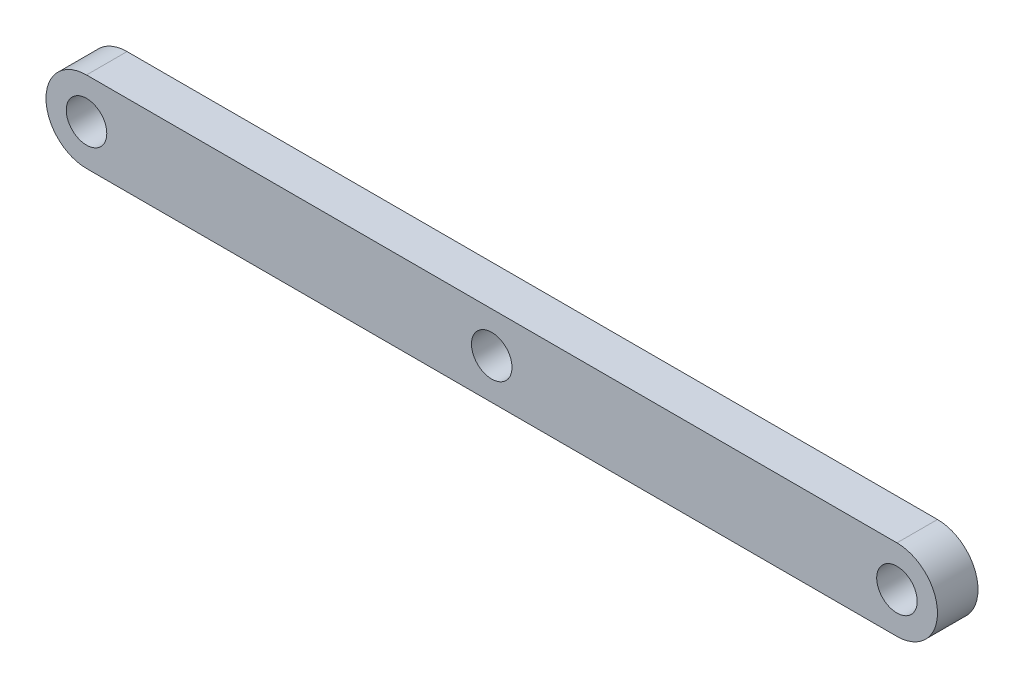
ISO-10303-21;
HEADER;
FILE_DESCRIPTION(('STEP AP214'),'2;1');
FILE_NAME('part.step','',(''),(''),'','','');
FILE_SCHEMA(('AUTOMOTIVE_DESIGN { 1 0 10303 214 1 1 1 1 }'));
ENDSEC;
DATA;
#1=APPLICATION_CONTEXT('core data for automotive mechanical design processes');
#2=APPLICATION_PROTOCOL_DEFINITION('international standard','automotive_design',2000,#1);
#3=PRODUCT_CONTEXT('',#1,'mechanical');
#4=PRODUCT('Part','Part','',(#3));
#5=PRODUCT_RELATED_PRODUCT_CATEGORY('part','',(#4));
#6=PRODUCT_DEFINITION_FORMATION('','',#4);
#7=PRODUCT_DEFINITION_CONTEXT('part definition',#1,'design');
#8=PRODUCT_DEFINITION('design','',#6,#7);
#9=PRODUCT_DEFINITION_SHAPE('','',#8);
#10=(LENGTH_UNIT() NAMED_UNIT(*) SI_UNIT(.MILLI.,.METRE.));
#11=(NAMED_UNIT(*) PLANE_ANGLE_UNIT() SI_UNIT($,.RADIAN.));
#12=(NAMED_UNIT(*) SI_UNIT($,.STERADIAN.) SOLID_ANGLE_UNIT());
#13=UNCERTAINTY_MEASURE_WITH_UNIT(LENGTH_MEASURE(1.E-05),#10,'distance_accuracy_value','');
#14=(GEOMETRIC_REPRESENTATION_CONTEXT(3) GLOBAL_UNCERTAINTY_ASSIGNED_CONTEXT((#13)) GLOBAL_UNIT_ASSIGNED_CONTEXT((#10,
#11,#12)) REPRESENTATION_CONTEXT('',''));
#15=CARTESIAN_POINT('',(0.,0.,0.));
#16=DIRECTION('',(0.,0.,1.));
#17=DIRECTION('',(1.,0.,0.));
#18=AXIS2_PLACEMENT_3D('',#15,#16,#17);
#19=CARTESIAN_POINT('',(0.,0.,10.));
#20=DIRECTION('',(0.,0.,1.));
#21=DIRECTION('',(1.,0.,0.));
#22=AXIS2_PLACEMENT_3D('',#19,#20,#21);
#23=PLANE('',#22);
#24=CARTESIAN_POINT('',(200.,0.,10.));
#25=DIRECTION('',(0.,0.,1.));
#26=DIRECTION('',(1.,0.,0.));
#27=AXIS2_PLACEMENT_3D('',#24,#25,#26);
#28=CIRCLE('',#27,4.99999999999999);
#29=CARTESIAN_POINT('',(205.,0.,10.));
#30=VERTEX_POINT('',#29);
#31=EDGE_CURVE('E115',#30,#30,#28,.T.);
#32=ORIENTED_EDGE('',*,*,#31,.F.);
#33=EDGE_LOOP('',(#32));
#34=FACE_BOUND('',#33,.T.);
#35=CARTESIAN_POINT('',(0.,0.,10.));
#36=DIRECTION('',(0.,0.,1.));
#37=DIRECTION('',(1.,0.,0.));
#38=AXIS2_PLACEMENT_3D('',#35,#36,#37);
#39=CIRCLE('',#38,9.99999999999999);
#40=CARTESIAN_POINT('',(0.,9.99999999999999,10.));
#41=VERTEX_POINT('',#40);
#42=CARTESIAN_POINT('',(0.,-9.99999999999999,10.));
#43=VERTEX_POINT('',#42);
#44=EDGE_CURVE('E85',#41,#43,#39,.T.);
#45=ORIENTED_EDGE('',*,*,#44,.T.);
#46=DIRECTION('',(1.,0.,0.));
#47=VECTOR('',#46,1.);
#48=CARTESIAN_POINT('',(0.,-9.99999999999999,10.));
#49=LINE('',#48,#47);
#50=CARTESIAN_POINT('',(200.,-9.99999999999999,10.));
#51=VERTEX_POINT('',#50);
#52=EDGE_CURVE('E80',#43,#51,#49,.T.);
#53=ORIENTED_EDGE('',*,*,#52,.T.);
#54=CARTESIAN_POINT('',(200.,0.,10.));
#55=DIRECTION('',(0.,0.,1.));
#56=DIRECTION('',(1.,0.,0.));
#57=AXIS2_PLACEMENT_3D('',#54,#55,#56);
#58=CIRCLE('',#57,9.99999999999999);
#59=CARTESIAN_POINT('',(200.,9.99999999999999,10.));
#60=VERTEX_POINT('',#59);
#61=EDGE_CURVE('E83',#51,#60,#58,.T.);
#62=ORIENTED_EDGE('',*,*,#61,.T.);
#63=DIRECTION('',(-1.,0.,0.));
#64=VECTOR('',#63,1.);
#65=CARTESIAN_POINT('',(0.,9.99999999999999,10.));
#66=LINE('',#65,#64);
#67=EDGE_CURVE('E50',#60,#41,#66,.T.);
#68=ORIENTED_EDGE('',*,*,#67,.T.);
#69=EDGE_LOOP('',(#45,#53,#62,#68));
#70=FACE_BOUND('',#69,.T.);
#71=CARTESIAN_POINT('',(0.,0.,10.));
#72=DIRECTION('',(0.,0.,1.));
#73=DIRECTION('',(1.,0.,0.));
#74=AXIS2_PLACEMENT_3D('',#71,#72,#73);
#75=CIRCLE('',#74,5.);
#76=CARTESIAN_POINT('',(5.,0.,10.));
#77=VERTEX_POINT('',#76);
#78=EDGE_CURVE('E100',#77,#77,#75,.T.);
#79=ORIENTED_EDGE('',*,*,#78,.F.);
#80=EDGE_LOOP('',(#79));
#81=FACE_BOUND('',#80,.T.);
#82=CARTESIAN_POINT('',(100.,0.,10.));
#83=DIRECTION('',(0.,0.,1.));
#84=DIRECTION('',(1.,0.,0.));
#85=AXIS2_PLACEMENT_3D('',#82,#83,#84);
#86=CIRCLE('',#85,5.);
#87=CARTESIAN_POINT('',(105.,0.,10.));
#88=VERTEX_POINT('',#87);
#89=EDGE_CURVE('E121',#88,#88,#86,.T.);
#90=ORIENTED_EDGE('',*,*,#89,.F.);
#91=EDGE_LOOP('',(#90));
#92=FACE_BOUND('',#91,.T.);
#93=ADVANCED_FACE('F33',(#34,#70,#81,#92),#23,.T.);
#94=CARTESIAN_POINT('',(0.,0.,0.));
#95=DIRECTION('',(0.,0.,1.));
#96=DIRECTION('',(1.,0.,0.));
#97=AXIS2_PLACEMENT_3D('',#94,#95,#96);
#98=PLANE('',#97);
#99=CARTESIAN_POINT('',(0.,0.,0.));
#100=DIRECTION('',(0.,0.,1.));
#101=DIRECTION('',(1.,0.,0.));
#102=AXIS2_PLACEMENT_3D('',#99,#100,#101);
#103=CIRCLE('',#102,9.99999999999999);
#104=CARTESIAN_POINT('',(0.,9.99999999999999,0.));
#105=VERTEX_POINT('',#104);
#106=CARTESIAN_POINT('',(0.,-9.99999999999999,0.));
#107=VERTEX_POINT('',#106);
#108=EDGE_CURVE('E97',#105,#107,#103,.T.);
#109=ORIENTED_EDGE('',*,*,#108,.F.);
#110=DIRECTION('',(-1.,0.,0.));
#111=VECTOR('',#110,1.);
#112=CARTESIAN_POINT('',(0.,9.99999999999999,0.));
#113=LINE('',#112,#111);
#114=CARTESIAN_POINT('',(200.,9.99999999999999,0.));
#115=VERTEX_POINT('',#114);
#116=EDGE_CURVE('E73',#115,#105,#113,.T.);
#117=ORIENTED_EDGE('',*,*,#116,.F.);
#118=CARTESIAN_POINT('',(200.,0.,0.));
#119=DIRECTION('',(0.,0.,1.));
#120=DIRECTION('',(1.,0.,0.));
#121=AXIS2_PLACEMENT_3D('',#118,#119,#120);
#122=CIRCLE('',#121,9.99999999999999);
#123=CARTESIAN_POINT('',(200.,-9.99999999999999,0.));
#124=VERTEX_POINT('',#123);
#125=EDGE_CURVE('E67',#124,#115,#122,.T.);
#126=ORIENTED_EDGE('',*,*,#125,.F.);
#127=DIRECTION('',(1.,0.,0.));
#128=VECTOR('',#127,1.);
#129=CARTESIAN_POINT('',(0.,-9.99999999999999,0.));
#130=LINE('',#129,#128);
#131=EDGE_CURVE('E89',#107,#124,#130,.T.);
#132=ORIENTED_EDGE('',*,*,#131,.F.);
#133=EDGE_LOOP('',(#109,#117,#126,#132));
#134=FACE_BOUND('',#133,.T.);
#135=CARTESIAN_POINT('',(0.,0.,0.));
#136=DIRECTION('',(0.,0.,1.));
#137=DIRECTION('',(1.,0.,0.));
#138=AXIS2_PLACEMENT_3D('',#135,#136,#137);
#139=CIRCLE('',#138,5.);
#140=CARTESIAN_POINT('',(5.,0.,0.));
#141=VERTEX_POINT('',#140);
#142=EDGE_CURVE('E112',#141,#141,#139,.T.);
#143=ORIENTED_EDGE('',*,*,#142,.T.);
#144=EDGE_LOOP('',(#143));
#145=FACE_BOUND('',#144,.T.);
#146=CARTESIAN_POINT('',(200.,0.,0.));
#147=DIRECTION('',(0.,0.,1.));
#148=DIRECTION('',(1.,0.,0.));
#149=AXIS2_PLACEMENT_3D('',#146,#147,#148);
#150=CIRCLE('',#149,4.99999999999999);
#151=CARTESIAN_POINT('',(205.,0.,0.));
#152=VERTEX_POINT('',#151);
#153=EDGE_CURVE('E118',#152,#152,#150,.T.);
#154=ORIENTED_EDGE('',*,*,#153,.T.);
#155=EDGE_LOOP('',(#154));
#156=FACE_BOUND('',#155,.T.);
#157=CARTESIAN_POINT('',(100.,0.,0.));
#158=DIRECTION('',(0.,0.,1.));
#159=DIRECTION('',(1.,0.,0.));
#160=AXIS2_PLACEMENT_3D('',#157,#158,#159);
#161=CIRCLE('',#160,5.);
#162=CARTESIAN_POINT('',(105.,0.,0.));
#163=VERTEX_POINT('',#162);
#164=EDGE_CURVE('E124',#163,#163,#161,.T.);
#165=ORIENTED_EDGE('',*,*,#164,.T.);
#166=EDGE_LOOP('',(#165));
#167=FACE_BOUND('',#166,.T.);
#168=ADVANCED_FACE('F108',(#134,#145,#156,#167),#98,.F.);
#169=CARTESIAN_POINT('',(0.,0.,10.));
#170=DIRECTION('',(0.,0.,-1.));
#171=DIRECTION('',(-1.,0.,0.));
#172=AXIS2_PLACEMENT_3D('',#169,#170,#171);
#173=CYLINDRICAL_SURFACE('',#172,9.99999999999999);
#174=ORIENTED_EDGE('',*,*,#108,.T.);
#175=DIRECTION('',(0.,0.,-1.));
#176=VECTOR('',#175,1.);
#177=CARTESIAN_POINT('',(0.,-9.99999999999999,10.));
#178=LINE('',#177,#176);
#179=EDGE_CURVE('E11',#43,#107,#178,.T.);
#180=ORIENTED_EDGE('',*,*,#179,.F.);
#181=ORIENTED_EDGE('',*,*,#44,.F.);
#182=DIRECTION('',(0.,0.,-1.));
#183=VECTOR('',#182,1.);
#184=CARTESIAN_POINT('',(0.,9.99999999999999,10.));
#185=LINE('',#184,#183);
#186=EDGE_CURVE('E93',#41,#105,#185,.T.);
#187=ORIENTED_EDGE('',*,*,#186,.T.);
#188=EDGE_LOOP('',(#174,#180,#181,#187));
#189=FACE_BOUND('',#188,.T.);
#190=ADVANCED_FACE('F35',(#189),#173,.T.);
#191=CARTESIAN_POINT('',(0.,-9.99999999999999,10.));
#192=DIRECTION('',(0.,1.,0.));
#193=DIRECTION('',(0.,0.,1.));
#194=AXIS2_PLACEMENT_3D('',#191,#192,#193);
#195=PLANE('',#194);
#196=ORIENTED_EDGE('',*,*,#131,.T.);
#197=DIRECTION('',(0.,0.,-1.));
#198=VECTOR('',#197,1.);
#199=CARTESIAN_POINT('',(200.,-9.99999999999999,10.));
#200=LINE('',#199,#198);
#201=EDGE_CURVE('E42',#51,#124,#200,.T.);
#202=ORIENTED_EDGE('',*,*,#201,.F.);
#203=ORIENTED_EDGE('',*,*,#52,.F.);
#204=ORIENTED_EDGE('',*,*,#179,.T.);
#205=EDGE_LOOP('',(#196,#202,#203,#204));
#206=FACE_BOUND('',#205,.T.);
#207=ADVANCED_FACE('F88',(#206),#195,.F.);
#208=CARTESIAN_POINT('',(200.,0.,10.));
#209=DIRECTION('',(0.,0.,-1.));
#210=DIRECTION('',(-1.,0.,0.));
#211=AXIS2_PLACEMENT_3D('',#208,#209,#210);
#212=CYLINDRICAL_SURFACE('',#211,9.99999999999999);
#213=ORIENTED_EDGE('',*,*,#125,.T.);
#214=DIRECTION('',(0.,0.,-1.));
#215=VECTOR('',#214,1.);
#216=CARTESIAN_POINT('',(200.,9.99999999999999,10.));
#217=LINE('',#216,#215);
#218=EDGE_CURVE('E90',#60,#115,#217,.T.);
#219=ORIENTED_EDGE('',*,*,#218,.F.);
#220=ORIENTED_EDGE('',*,*,#61,.F.);
#221=ORIENTED_EDGE('',*,*,#201,.T.);
#222=EDGE_LOOP('',(#213,#219,#220,#221));
#223=FACE_BOUND('',#222,.T.);
#224=ADVANCED_FACE('F91',(#223),#212,.T.);
#225=CARTESIAN_POINT('',(0.,9.99999999999999,10.));
#226=DIRECTION('',(0.,-1.,0.));
#227=DIRECTION('',(0.,0.,-1.));
#228=AXIS2_PLACEMENT_3D('',#225,#226,#227);
#229=PLANE('',#228);
#230=ORIENTED_EDGE('',*,*,#116,.T.);
#231=ORIENTED_EDGE('',*,*,#186,.F.);
#232=ORIENTED_EDGE('',*,*,#67,.F.);
#233=ORIENTED_EDGE('',*,*,#218,.T.);
#234=EDGE_LOOP('',(#230,#231,#232,#233));
#235=FACE_BOUND('',#234,.T.);
#236=ADVANCED_FACE('F105',(#235),#229,.F.);
#237=CARTESIAN_POINT('',(0.,0.,10.));
#238=DIRECTION('',(0.,0.,-1.));
#239=DIRECTION('',(-1.,0.,0.));
#240=AXIS2_PLACEMENT_3D('',#237,#238,#239);
#241=CYLINDRICAL_SURFACE('',#240,5.);
#242=ORIENTED_EDGE('',*,*,#78,.T.);
#243=EDGE_LOOP('',(#242));
#244=FACE_BOUND('',#243,.T.);
#245=ORIENTED_EDGE('',*,*,#142,.F.);
#246=EDGE_LOOP('',(#245));
#247=FACE_BOUND('',#246,.T.);
#248=ADVANCED_FACE('F142',(#244,#247),#241,.F.);
#249=CARTESIAN_POINT('',(200.,0.,10.));
#250=DIRECTION('',(0.,0.,-1.));
#251=DIRECTION('',(-1.,0.,0.));
#252=AXIS2_PLACEMENT_3D('',#249,#250,#251);
#253=CYLINDRICAL_SURFACE('',#252,4.99999999999999);
#254=ORIENTED_EDGE('',*,*,#31,.T.);
#255=EDGE_LOOP('',(#254));
#256=FACE_BOUND('',#255,.T.);
#257=ORIENTED_EDGE('',*,*,#153,.F.);
#258=EDGE_LOOP('',(#257));
#259=FACE_BOUND('',#258,.T.);
#260=ADVANCED_FACE('F188',(#256,#259),#253,.F.);
#261=CARTESIAN_POINT('',(100.,0.,10.));
#262=DIRECTION('',(0.,0.,-1.));
#263=DIRECTION('',(-1.,0.,0.));
#264=AXIS2_PLACEMENT_3D('',#261,#262,#263);
#265=CYLINDRICAL_SURFACE('',#264,5.);
#266=ORIENTED_EDGE('',*,*,#89,.T.);
#267=EDGE_LOOP('',(#266));
#268=FACE_BOUND('',#267,.T.);
#269=ORIENTED_EDGE('',*,*,#164,.F.);
#270=EDGE_LOOP('',(#269));
#271=FACE_BOUND('',#270,.T.);
#272=ADVANCED_FACE('F130',(#268,#271),#265,.F.);
#273=CLOSED_SHELL('',(#93,#168,#190,#207,#224,#236,#248,#260,#272));
#274=MANIFOLD_SOLID_BREP('B2',#273);
#275=ADVANCED_BREP_SHAPE_REPRESENTATION('',(#18,#274),#14);
#276=SHAPE_DEFINITION_REPRESENTATION(#9,#275);
ENDSEC;
END-ISO-10303-21;
